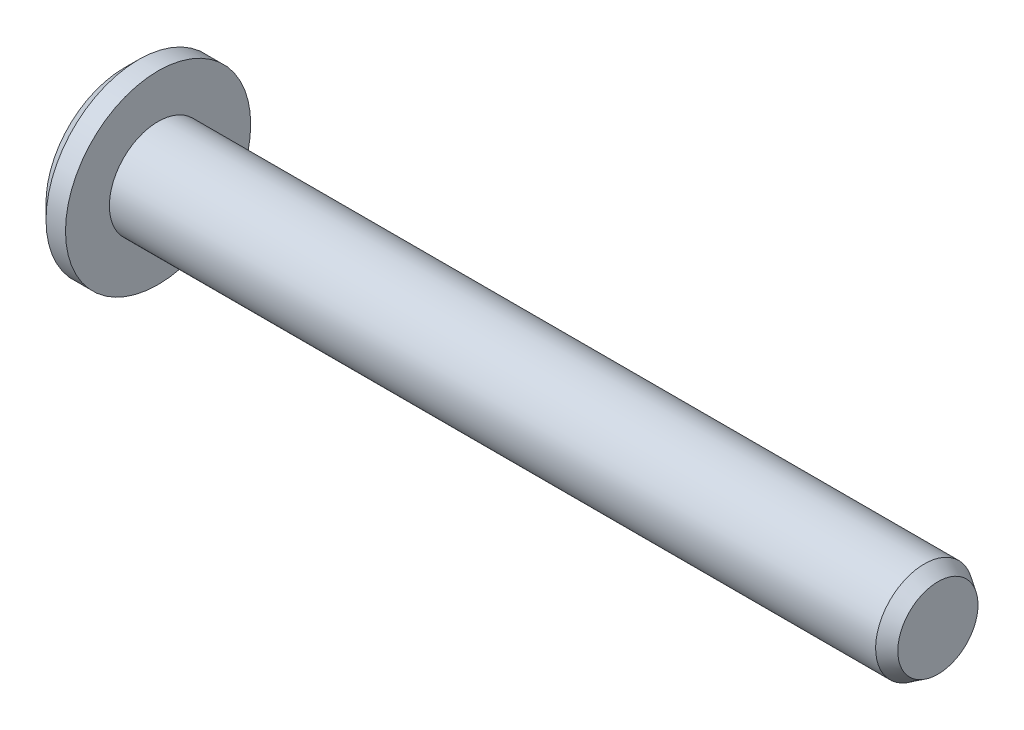
ISO-10303-21;
HEADER;
FILE_DESCRIPTION(('STEP AP214'),'2;1');
FILE_NAME('part.step','',(''),(''),'','','');
FILE_SCHEMA(('AUTOMOTIVE_DESIGN { 1 0 10303 214 1 1 1 1 }'));
ENDSEC;
DATA;
#1=APPLICATION_CONTEXT('core data for automotive mechanical design processes');
#2=APPLICATION_PROTOCOL_DEFINITION('international standard','automotive_design',2000,#1);
#3=PRODUCT_CONTEXT('',#1,'mechanical');
#4=PRODUCT('Part','Part','',(#3));
#5=PRODUCT_RELATED_PRODUCT_CATEGORY('part','',(#4));
#6=PRODUCT_DEFINITION_FORMATION('','',#4);
#7=PRODUCT_DEFINITION_CONTEXT('part definition',#1,'design');
#8=PRODUCT_DEFINITION('design','',#6,#7);
#9=PRODUCT_DEFINITION_SHAPE('','',#8);
#10=(LENGTH_UNIT() NAMED_UNIT(*) SI_UNIT(.MILLI.,.METRE.));
#11=(NAMED_UNIT(*) PLANE_ANGLE_UNIT() SI_UNIT($,.RADIAN.));
#12=(NAMED_UNIT(*) SI_UNIT($,.STERADIAN.) SOLID_ANGLE_UNIT());
#13=UNCERTAINTY_MEASURE_WITH_UNIT(LENGTH_MEASURE(1.E-05),#10,'distance_accuracy_value','');
#14=(GEOMETRIC_REPRESENTATION_CONTEXT(3) GLOBAL_UNCERTAINTY_ASSIGNED_CONTEXT((#13)) GLOBAL_UNIT_ASSIGNED_CONTEXT((#10,
#11,#12)) REPRESENTATION_CONTEXT('',''));
#15=CARTESIAN_POINT('',(0.,0.,0.));
#16=DIRECTION('',(0.,0.,1.));
#17=DIRECTION('',(1.,0.,0.));
#18=AXIS2_PLACEMENT_3D('',#15,#16,#17);
#19=CARTESIAN_POINT('',(41.75,0.,0.));
#20=DIRECTION('',(-1.,0.,0.));
#21=DIRECTION('',(0.,-1.,0.));
#22=AXIS2_PLACEMENT_3D('',#19,#20,#21);
#23=PLANE('',#22);
#24=CARTESIAN_POINT('',(41.75,0.,0.));
#25=DIRECTION('',(-1.,0.,0.));
#26=DIRECTION('',(0.,-1.,0.));
#27=AXIS2_PLACEMENT_3D('',#24,#25,#26);
#28=CIRCLE('',#27,2.05723616873881);
#29=CARTESIAN_POINT('',(41.75,-2.05723616873882,0.));
#30=VERTEX_POINT('',#29);
#31=EDGE_CURVE('E148',#30,#30,#28,.T.);
#32=ORIENTED_EDGE('',*,*,#31,.F.);
#33=EDGE_LOOP('',(#32));
#34=FACE_BOUND('',#33,.T.);
#35=ADVANCED_FACE('F32',(#34),#23,.F.);
#36=CARTESIAN_POINT('',(41.75,0.,0.));
#37=DIRECTION('',(-1.,0.,0.));
#38=DIRECTION('',(0.,-1.,0.));
#39=AXIS2_PLACEMENT_3D('',#36,#37,#38);
#40=CONICAL_SURFACE('',#39,2.05723616873881,0.567232006898155);
#41=CARTESIAN_POINT('',(41.055,0.,0.));
#42=DIRECTION('',(-1.,0.,0.));
#43=DIRECTION('',(0.,-1.,0.));
#44=AXIS2_PLACEMENT_3D('',#41,#42,#43);
#45=CIRCLE('',#44,2.50000000000003);
#46=CARTESIAN_POINT('',(41.055,-2.50000000000004,0.));
#47=VERTEX_POINT('',#46);
#48=EDGE_CURVE('E145',#47,#47,#45,.T.);
#49=ORIENTED_EDGE('',*,*,#48,.F.);
#50=EDGE_LOOP('',(#49));
#51=FACE_BOUND('',#50,.T.);
#52=ORIENTED_EDGE('',*,*,#31,.T.);
#53=EDGE_LOOP('',(#52));
#54=FACE_BOUND('',#53,.T.);
#55=ADVANCED_FACE('F165',(#51,#54),#40,.T.);
#56=CARTESIAN_POINT('',(0.,0.,0.));
#57=DIRECTION('',(-1.,0.,0.));
#58=DIRECTION('',(0.,-1.,0.));
#59=AXIS2_PLACEMENT_3D('',#56,#57,#58);
#60=CYLINDRICAL_SURFACE('',#59,2.50000000000002);
#61=CARTESIAN_POINT('',(1.75,0.,0.));
#62=DIRECTION('',(-1.,0.,0.));
#63=DIRECTION('',(0.,-1.,0.));
#64=AXIS2_PLACEMENT_3D('',#61,#62,#63);
#65=CIRCLE('',#64,2.50000000000002);
#66=CARTESIAN_POINT('',(1.75,-2.50000000000002,0.));
#67=VERTEX_POINT('',#66);
#68=EDGE_CURVE('E142',#67,#67,#65,.T.);
#69=ORIENTED_EDGE('',*,*,#68,.F.);
#70=EDGE_LOOP('',(#69));
#71=FACE_BOUND('',#70,.T.);
#72=ORIENTED_EDGE('',*,*,#48,.T.);
#73=EDGE_LOOP('',(#72));
#74=FACE_BOUND('',#73,.T.);
#75=ADVANCED_FACE('F170',(#71,#74),#60,.T.);
#76=CARTESIAN_POINT('',(1.75,2.50000000000002,0.));
#77=DIRECTION('',(-1.,0.,0.));
#78=DIRECTION('',(0.,-1.,0.));
#79=AXIS2_PLACEMENT_3D('',#76,#77,#78);
#80=PLANE('',#79);
#81=CARTESIAN_POINT('',(1.75,0.,0.));
#82=DIRECTION('',(-1.,0.,0.));
#83=DIRECTION('',(0.,-1.,0.));
#84=AXIS2_PLACEMENT_3D('',#81,#82,#83);
#85=CIRCLE('',#84,4.75000000000001);
#86=CARTESIAN_POINT('',(1.75,-4.75000000000001,0.));
#87=VERTEX_POINT('',#86);
#88=EDGE_CURVE('E134',#87,#87,#85,.T.);
#89=ORIENTED_EDGE('',*,*,#88,.F.);
#90=EDGE_LOOP('',(#89));
#91=FACE_BOUND('',#90,.T.);
#92=ORIENTED_EDGE('',*,*,#68,.T.);
#93=EDGE_LOOP('',(#92));
#94=FACE_BOUND('',#93,.T.);
#95=ADVANCED_FACE('F177',(#91,#94),#80,.F.);
#96=CARTESIAN_POINT('',(0.,0.,0.));
#97=DIRECTION('',(-1.,0.,0.));
#98=DIRECTION('',(0.,-1.,0.));
#99=AXIS2_PLACEMENT_3D('',#96,#97,#98);
#100=CYLINDRICAL_SURFACE('',#99,4.75000000000001);
#101=CARTESIAN_POINT('',(0.749999999999998,0.,0.));
#102=DIRECTION('',(1.,0.,0.));
#103=DIRECTION('',(0.,1.,0.));
#104=AXIS2_PLACEMENT_3D('',#101,#102,#103);
#105=CIRCLE('',#104,4.75000000000001);
#106=CARTESIAN_POINT('',(0.749999999999999,4.75000000000001,0.));
#107=VERTEX_POINT('',#106);
#108=EDGE_CURVE('E11',#107,#107,#105,.T.);
#109=ORIENTED_EDGE('',*,*,#108,.T.);
#110=EDGE_LOOP('',(#109));
#111=FACE_BOUND('',#110,.T.);
#112=ORIENTED_EDGE('',*,*,#88,.T.);
#113=EDGE_LOOP('',(#112));
#114=FACE_BOUND('',#113,.T.);
#115=ADVANCED_FACE('F181',(#111,#114),#100,.T.);
#116=CARTESIAN_POINT('',(0.,4.75000000000001,0.));
#117=DIRECTION('',(1.,0.,0.));
#118=DIRECTION('',(0.,1.,0.));
#119=AXIS2_PLACEMENT_3D('',#116,#117,#118);
#120=PLANE('',#119);
#121=CARTESIAN_POINT('',(0.,0.,0.));
#122=DIRECTION('',(1.,0.,0.));
#123=DIRECTION('',(0.,1.,0.));
#124=AXIS2_PLACEMENT_3D('',#121,#122,#123);
#125=CIRCLE('',#124,4.00000000000002);
#126=CARTESIAN_POINT('',(0.,4.00000000000002,0.));
#127=VERTEX_POINT('',#126);
#128=EDGE_CURVE('E40',#127,#127,#125,.F.);
#129=ORIENTED_EDGE('',*,*,#128,.T.);
#130=EDGE_LOOP('',(#129));
#131=FACE_BOUND('',#130,.T.);
#132=DIRECTION('',(0.,1.,0.));
#133=VECTOR('',#132,1.);
#134=CARTESIAN_POINT('',(0.,-0.866025403784439,1.5));
#135=LINE('',#134,#133);
#136=CARTESIAN_POINT('',(0.,-0.86602540378444,1.5));
#137=VERTEX_POINT('',#136);
#138=CARTESIAN_POINT('',(0.,0.86602540378444,1.5));
#139=VERTEX_POINT('',#138);
#140=EDGE_CURVE('E121',#137,#139,#135,.T.);
#141=ORIENTED_EDGE('',*,*,#140,.F.);
#142=DIRECTION('',(0.,0.5,0.866025403784439));
#143=VECTOR('',#142,1.);
#144=CARTESIAN_POINT('',(0.,-1.73205080756888,0.));
#145=LINE('',#144,#143);
#146=CARTESIAN_POINT('',(0.,-1.73205080756888,0.));
#147=VERTEX_POINT('',#146);
#148=EDGE_CURVE('E47',#147,#137,#145,.T.);
#149=ORIENTED_EDGE('',*,*,#148,.F.);
#150=DIRECTION('',(0.,-0.5,0.866025403784439));
#151=VECTOR('',#150,1.);
#152=CARTESIAN_POINT('',(0.,-0.866025403784439,-1.5));
#153=LINE('',#152,#151);
#154=CARTESIAN_POINT('',(0.,-0.866025403784439,-1.5));
#155=VERTEX_POINT('',#154);
#156=EDGE_CURVE('E130',#155,#147,#153,.T.);
#157=ORIENTED_EDGE('',*,*,#156,.F.);
#158=DIRECTION('',(0.,-1.,0.));
#159=VECTOR('',#158,1.);
#160=CARTESIAN_POINT('',(0.,0.86602540378444,-1.5));
#161=LINE('',#160,#159);
#162=CARTESIAN_POINT('',(0.,0.86602540378444,-1.5));
#163=VERTEX_POINT('',#162);
#164=EDGE_CURVE('E128',#163,#155,#161,.T.);
#165=ORIENTED_EDGE('',*,*,#164,.F.);
#166=DIRECTION('',(0.,-0.5,-0.866025403784439));
#167=VECTOR('',#166,1.);
#168=CARTESIAN_POINT('',(0.,1.73205080756888,0.));
#169=LINE('',#168,#167);
#170=CARTESIAN_POINT('',(0.,1.73205080756888,0.));
#171=VERTEX_POINT('',#170);
#172=EDGE_CURVE('E95',#171,#163,#169,.T.);
#173=ORIENTED_EDGE('',*,*,#172,.F.);
#174=DIRECTION('',(0.,0.5,-0.866025403784439));
#175=VECTOR('',#174,1.);
#176=CARTESIAN_POINT('',(0.,0.86602540378444,1.5));
#177=LINE('',#176,#175);
#178=EDGE_CURVE('E124',#139,#171,#177,.T.);
#179=ORIENTED_EDGE('',*,*,#178,.F.);
#180=EDGE_LOOP('',(#141,#149,#157,#165,#173,#179));
#181=FACE_BOUND('',#180,.T.);
#182=ADVANCED_FACE('F153',(#131,#181),#120,.F.);
#183=CARTESIAN_POINT('',(1.,-1.73205080756888,0.));
#184=DIRECTION('',(0.,-0.866025403784439,0.5));
#185=DIRECTION('',(0.,-0.5,-0.866025403784439));
#186=AXIS2_PLACEMENT_3D('',#183,#184,#185);
#187=PLANE('',#186);
#188=ORIENTED_EDGE('',*,*,#148,.T.);
#189=DIRECTION('',(-1.,0.,0.));
#190=VECTOR('',#189,1.);
#191=CARTESIAN_POINT('',(1.,-0.866025403784439,1.5));
#192=LINE('',#191,#190);
#193=CARTESIAN_POINT('',(1.,-0.866025403784439,1.5));
#194=VERTEX_POINT('',#193);
#195=EDGE_CURVE('E77',#194,#137,#192,.T.);
#196=ORIENTED_EDGE('',*,*,#195,.F.);
#197=DIRECTION('',(0.,0.5,0.866025403784439));
#198=VECTOR('',#197,1.);
#199=CARTESIAN_POINT('',(1.,-1.73205080756888,0.));
#200=LINE('',#199,#198);
#201=CARTESIAN_POINT('',(1.,-1.73205080756888,0.));
#202=VERTEX_POINT('',#201);
#203=EDGE_CURVE('E132',#202,#194,#200,.T.);
#204=ORIENTED_EDGE('',*,*,#203,.F.);
#205=DIRECTION('',(-1.,0.,0.));
#206=VECTOR('',#205,1.);
#207=CARTESIAN_POINT('',(1.,-1.73205080756888,0.));
#208=LINE('',#207,#206);
#209=EDGE_CURVE('E55',#202,#147,#208,.T.);
#210=ORIENTED_EDGE('',*,*,#209,.T.);
#211=EDGE_LOOP('',(#188,#196,#204,#210));
#212=FACE_BOUND('',#211,.T.);
#213=ADVANCED_FACE('F188',(#212),#187,.F.);
#214=CARTESIAN_POINT('',(1.,-0.866025403784439,-1.5));
#215=DIRECTION('',(0.,-0.866025403784439,-0.5));
#216=DIRECTION('',(0.,0.5,-0.866025403784439));
#217=AXIS2_PLACEMENT_3D('',#214,#215,#216);
#218=PLANE('',#217);
#219=ORIENTED_EDGE('',*,*,#156,.T.);
#220=ORIENTED_EDGE('',*,*,#209,.F.);
#221=DIRECTION('',(0.,-0.5,0.866025403784439));
#222=VECTOR('',#221,1.);
#223=CARTESIAN_POINT('',(1.,-0.866025403784439,-1.5));
#224=LINE('',#223,#222);
#225=CARTESIAN_POINT('',(1.,-0.866025403784439,-1.5));
#226=VERTEX_POINT('',#225);
#227=EDGE_CURVE('E107',#226,#202,#224,.T.);
#228=ORIENTED_EDGE('',*,*,#227,.F.);
#229=DIRECTION('',(-1.,0.,0.));
#230=VECTOR('',#229,1.);
#231=CARTESIAN_POINT('',(1.,-0.866025403784439,-1.5));
#232=LINE('',#231,#230);
#233=EDGE_CURVE('E99',#226,#155,#232,.T.);
#234=ORIENTED_EDGE('',*,*,#233,.T.);
#235=EDGE_LOOP('',(#219,#220,#228,#234));
#236=FACE_BOUND('',#235,.T.);
#237=ADVANCED_FACE('F191',(#236),#218,.F.);
#238=CARTESIAN_POINT('',(1.,0.86602540378444,-1.5));
#239=DIRECTION('',(0.,0.,-1.));
#240=DIRECTION('',(0.,1.,0.));
#241=AXIS2_PLACEMENT_3D('',#238,#239,#240);
#242=PLANE('',#241);
#243=ORIENTED_EDGE('',*,*,#164,.T.);
#244=ORIENTED_EDGE('',*,*,#233,.F.);
#245=DIRECTION('',(0.,-1.,0.));
#246=VECTOR('',#245,1.);
#247=CARTESIAN_POINT('',(1.,0.86602540378444,-1.5));
#248=LINE('',#247,#246);
#249=CARTESIAN_POINT('',(1.,0.86602540378444,-1.5));
#250=VERTEX_POINT('',#249);
#251=EDGE_CURVE('E103',#250,#226,#248,.T.);
#252=ORIENTED_EDGE('',*,*,#251,.F.);
#253=DIRECTION('',(-1.,0.,0.));
#254=VECTOR('',#253,1.);
#255=CARTESIAN_POINT('',(1.,0.86602540378444,-1.5));
#256=LINE('',#255,#254);
#257=EDGE_CURVE('E88',#250,#163,#256,.T.);
#258=ORIENTED_EDGE('',*,*,#257,.T.);
#259=EDGE_LOOP('',(#243,#244,#252,#258));
#260=FACE_BOUND('',#259,.T.);
#261=ADVANCED_FACE('F104',(#260),#242,.F.);
#262=CARTESIAN_POINT('',(1.,1.73205080756888,0.));
#263=DIRECTION('',(0.,0.866025403784439,-0.5));
#264=DIRECTION('',(0.,0.5,0.866025403784439));
#265=AXIS2_PLACEMENT_3D('',#262,#263,#264);
#266=PLANE('',#265);
#267=ORIENTED_EDGE('',*,*,#172,.T.);
#268=ORIENTED_EDGE('',*,*,#257,.F.);
#269=DIRECTION('',(0.,-0.5,-0.866025403784439));
#270=VECTOR('',#269,1.);
#271=CARTESIAN_POINT('',(1.,1.73205080756888,0.));
#272=LINE('',#271,#270);
#273=CARTESIAN_POINT('',(1.,1.73205080756888,0.));
#274=VERTEX_POINT('',#273);
#275=EDGE_CURVE('E92',#274,#250,#272,.T.);
#276=ORIENTED_EDGE('',*,*,#275,.F.);
#277=DIRECTION('',(-1.,0.,0.));
#278=VECTOR('',#277,1.);
#279=CARTESIAN_POINT('',(1.,1.73205080756888,0.));
#280=LINE('',#279,#278);
#281=EDGE_CURVE('E100',#274,#171,#280,.T.);
#282=ORIENTED_EDGE('',*,*,#281,.T.);
#283=EDGE_LOOP('',(#267,#268,#276,#282));
#284=FACE_BOUND('',#283,.T.);
#285=ADVANCED_FACE('F90',(#284),#266,.F.);
#286=CARTESIAN_POINT('',(1.,0.86602540378444,1.5));
#287=DIRECTION('',(0.,0.866025403784439,0.5));
#288=DIRECTION('',(0.,-0.5,0.866025403784439));
#289=AXIS2_PLACEMENT_3D('',#286,#287,#288);
#290=PLANE('',#289);
#291=ORIENTED_EDGE('',*,*,#178,.T.);
#292=ORIENTED_EDGE('',*,*,#281,.F.);
#293=DIRECTION('',(0.,0.5,-0.866025403784439));
#294=VECTOR('',#293,1.);
#295=CARTESIAN_POINT('',(1.,0.86602540378444,1.5));
#296=LINE('',#295,#294);
#297=CARTESIAN_POINT('',(1.,0.86602540378444,1.5));
#298=VERTEX_POINT('',#297);
#299=EDGE_CURVE('E113',#298,#274,#296,.T.);
#300=ORIENTED_EDGE('',*,*,#299,.F.);
#301=DIRECTION('',(-1.,0.,0.));
#302=VECTOR('',#301,1.);
#303=CARTESIAN_POINT('',(1.,0.86602540378444,1.5));
#304=LINE('',#303,#302);
#305=EDGE_CURVE('E137',#298,#139,#304,.T.);
#306=ORIENTED_EDGE('',*,*,#305,.T.);
#307=EDGE_LOOP('',(#291,#292,#300,#306));
#308=FACE_BOUND('',#307,.T.);
#309=ADVANCED_FACE('F194',(#308),#290,.F.);
#310=CARTESIAN_POINT('',(1.,-0.866025403784439,1.5));
#311=DIRECTION('',(0.,0.,1.));
#312=DIRECTION('',(0.,-1.,0.));
#313=AXIS2_PLACEMENT_3D('',#310,#311,#312);
#314=PLANE('',#313);
#315=ORIENTED_EDGE('',*,*,#140,.T.);
#316=ORIENTED_EDGE('',*,*,#305,.F.);
#317=DIRECTION('',(0.,1.,0.));
#318=VECTOR('',#317,1.);
#319=CARTESIAN_POINT('',(1.,-0.866025403784439,1.5));
#320=LINE('',#319,#318);
#321=EDGE_CURVE('E115',#194,#298,#320,.T.);
#322=ORIENTED_EDGE('',*,*,#321,.F.);
#323=ORIENTED_EDGE('',*,*,#195,.T.);
#324=EDGE_LOOP('',(#315,#316,#322,#323));
#325=FACE_BOUND('',#324,.T.);
#326=ADVANCED_FACE('F161',(#325),#314,.F.);
#327=CARTESIAN_POINT('',(1.,0.,0.));
#328=DIRECTION('',(-1.,0.,0.));
#329=DIRECTION('',(0.,-1.,0.));
#330=AXIS2_PLACEMENT_3D('',#327,#328,#329);
#331=PLANE('',#330);
#332=ORIENTED_EDGE('',*,*,#203,.T.);
#333=ORIENTED_EDGE('',*,*,#321,.T.);
#334=ORIENTED_EDGE('',*,*,#299,.T.);
#335=ORIENTED_EDGE('',*,*,#275,.T.);
#336=ORIENTED_EDGE('',*,*,#251,.T.);
#337=ORIENTED_EDGE('',*,*,#227,.T.);
#338=EDGE_LOOP('',(#332,#333,#334,#335,#336,#337));
#339=FACE_BOUND('',#338,.T.);
#340=ADVANCED_FACE('F110',(#339),#331,.T.);
#341=CARTESIAN_POINT('',(0.,0.,0.));
#342=DIRECTION('',(1.,0.,0.));
#343=DIRECTION('',(0.,1.,0.));
#344=AXIS2_PLACEMENT_3D('',#341,#342,#343);
#345=CONICAL_SURFACE('',#344,4.00000000000002,0.785398163397442);
#346=ORIENTED_EDGE('',*,*,#108,.F.);
#347=EDGE_LOOP('',(#346));
#348=FACE_BOUND('',#347,.T.);
#349=ORIENTED_EDGE('',*,*,#128,.F.);
#350=EDGE_LOOP('',(#349));
#351=FACE_BOUND('',#350,.T.);
#352=ADVANCED_FACE('F34',(#348,#351),#345,.T.);
#353=CLOSED_SHELL('',(#35,#55,#75,#95,#115,#182,#213,#237,#261,#285,#309,#326,#340,#352));
#354=MANIFOLD_SOLID_BREP('B2',#353);
#355=ADVANCED_BREP_SHAPE_REPRESENTATION('',(#18,#354),#14);
#356=SHAPE_DEFINITION_REPRESENTATION(#9,#355);
ENDSEC;
END-ISO-10303-21;
